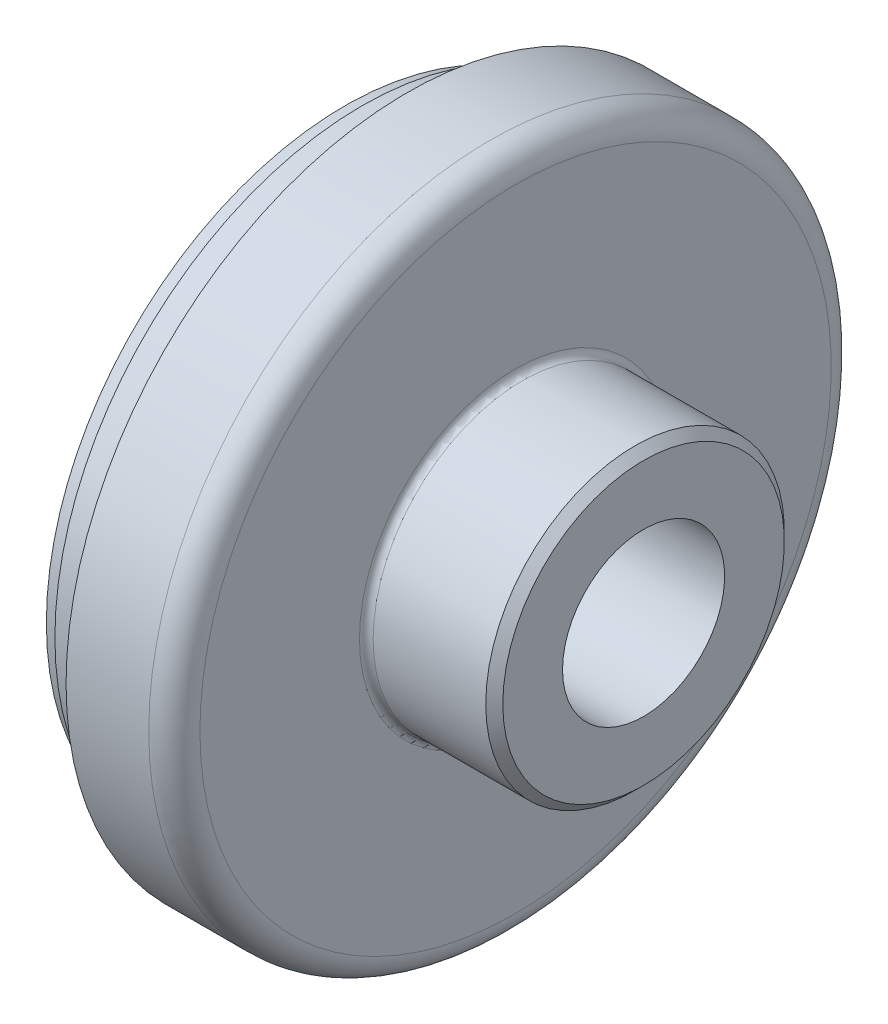
ISO-10303-21;
HEADER;
FILE_DESCRIPTION(('STEP AP214'),'2;1');
FILE_NAME('part.step','',(''),(''),'','','');
FILE_SCHEMA(('AUTOMOTIVE_DESIGN { 1 0 10303 214 1 1 1 1 }'));
ENDSEC;
DATA;
#1=APPLICATION_CONTEXT('core data for automotive mechanical design processes');
#2=APPLICATION_PROTOCOL_DEFINITION('international standard','automotive_design',2000,#1);
#3=PRODUCT_CONTEXT('',#1,'mechanical');
#4=PRODUCT('Part','Part','',(#3));
#5=PRODUCT_RELATED_PRODUCT_CATEGORY('part','',(#4));
#6=PRODUCT_DEFINITION_FORMATION('','',#4);
#7=PRODUCT_DEFINITION_CONTEXT('part definition',#1,'design');
#8=PRODUCT_DEFINITION('design','',#6,#7);
#9=PRODUCT_DEFINITION_SHAPE('','',#8);
#10=(LENGTH_UNIT() NAMED_UNIT(*) SI_UNIT(.MILLI.,.METRE.));
#11=(NAMED_UNIT(*) PLANE_ANGLE_UNIT() SI_UNIT($,.RADIAN.));
#12=(NAMED_UNIT(*) SI_UNIT($,.STERADIAN.) SOLID_ANGLE_UNIT());
#13=UNCERTAINTY_MEASURE_WITH_UNIT(LENGTH_MEASURE(1.E-05),#10,'distance_accuracy_value','');
#14=(GEOMETRIC_REPRESENTATION_CONTEXT(3) GLOBAL_UNCERTAINTY_ASSIGNED_CONTEXT((#13)) GLOBAL_UNIT_ASSIGNED_CONTEXT((#10,
#11,#12)) REPRESENTATION_CONTEXT('',''));
#15=CARTESIAN_POINT('',(0.,0.,0.));
#16=DIRECTION('',(0.,0.,1.));
#17=DIRECTION('',(1.,0.,0.));
#18=AXIS2_PLACEMENT_3D('',#15,#16,#17);
#19=CARTESIAN_POINT('',(0.,35.,0.));
#20=DIRECTION('',(1.,0.,0.));
#21=DIRECTION('',(0.,0.,-1.));
#22=AXIS2_PLACEMENT_3D('',#19,#20,#21);
#23=PLANE('',#22);
#24=CARTESIAN_POINT('',(0.,0.,0.));
#25=DIRECTION('',(-1.,0.,0.));
#26=DIRECTION('',(0.,0.,1.));
#27=AXIS2_PLACEMENT_3D('',#24,#25,#26);
#28=CIRCLE('',#27,9.5);
#29=CARTESIAN_POINT('',(0.,0.,9.5));
#30=VERTEX_POINT('',#29);
#31=EDGE_CURVE('E88',#30,#30,#28,.T.);
#32=ORIENTED_EDGE('',*,*,#31,.F.);
#33=EDGE_LOOP('',(#32));
#34=FACE_BOUND('',#33,.T.);
#35=CARTESIAN_POINT('',(0.,0.,0.));
#36=DIRECTION('',(-1.,0.,0.));
#37=DIRECTION('',(0.,0.,1.));
#38=AXIS2_PLACEMENT_3D('',#35,#36,#37);
#39=CIRCLE('',#38,35.);
#40=CARTESIAN_POINT('',(0.,0.,35.));
#41=VERTEX_POINT('',#40);
#42=EDGE_CURVE('E10',#41,#41,#39,.T.);
#43=ORIENTED_EDGE('',*,*,#42,.T.);
#44=EDGE_LOOP('',(#43));
#45=FACE_BOUND('',#44,.T.);
#46=ADVANCED_FACE('F45',(#34,#45),#23,.F.);
#47=CARTESIAN_POINT('',(-31.2769039735099,0.,0.));
#48=DIRECTION('',(-1.,0.,0.));
#49=DIRECTION('',(0.,0.,1.));
#50=AXIS2_PLACEMENT_3D('',#47,#48,#49);
#51=CYLINDRICAL_SURFACE('',#50,35.);
#52=ORIENTED_EDGE('',*,*,#42,.F.);
#53=EDGE_LOOP('',(#52));
#54=FACE_BOUND('',#53,.T.);
#55=CARTESIAN_POINT('',(2.,0.,0.));
#56=DIRECTION('',(-1.,0.,0.));
#57=DIRECTION('',(0.,0.,1.));
#58=AXIS2_PLACEMENT_3D('',#55,#56,#57);
#59=CIRCLE('',#58,35.);
#60=CARTESIAN_POINT('',(2.,0.,35.));
#61=VERTEX_POINT('',#60);
#62=EDGE_CURVE('E51',#61,#61,#59,.T.);
#63=ORIENTED_EDGE('',*,*,#62,.T.);
#64=EDGE_LOOP('',(#63));
#65=FACE_BOUND('',#64,.T.);
#66=ADVANCED_FACE('F95',(#54,#65),#51,.T.);
#67=CARTESIAN_POINT('',(2.,36.,0.));
#68=DIRECTION('',(1.,0.,0.));
#69=DIRECTION('',(0.,0.,-1.));
#70=AXIS2_PLACEMENT_3D('',#67,#68,#69);
#71=PLANE('',#70);
#72=ORIENTED_EDGE('',*,*,#62,.F.);
#73=EDGE_LOOP('',(#72));
#74=FACE_BOUND('',#73,.T.);
#75=CARTESIAN_POINT('',(2.,0.,0.));
#76=DIRECTION('',(-1.,0.,0.));
#77=DIRECTION('',(0.,0.,1.));
#78=AXIS2_PLACEMENT_3D('',#75,#76,#77);
#79=CIRCLE('',#78,36.);
#80=CARTESIAN_POINT('',(2.,0.,36.));
#81=VERTEX_POINT('',#80);
#82=EDGE_CURVE('E55',#81,#81,#79,.T.);
#83=ORIENTED_EDGE('',*,*,#82,.T.);
#84=EDGE_LOOP('',(#83));
#85=FACE_BOUND('',#84,.T.);
#86=ADVANCED_FACE('F99',(#74,#85),#71,.F.);
#87=CARTESIAN_POINT('',(-31.2769039735099,0.,0.));
#88=DIRECTION('',(-1.,0.,0.));
#89=DIRECTION('',(0.,0.,1.));
#90=AXIS2_PLACEMENT_3D('',#87,#88,#89);
#91=CYLINDRICAL_SURFACE('',#90,36.);
#92=ORIENTED_EDGE('',*,*,#82,.F.);
#93=EDGE_LOOP('',(#92));
#94=FACE_BOUND('',#93,.T.);
#95=CARTESIAN_POINT('',(5.,0.,0.));
#96=DIRECTION('',(-1.,0.,0.));
#97=DIRECTION('',(0.,0.,1.));
#98=AXIS2_PLACEMENT_3D('',#95,#96,#97);
#99=CIRCLE('',#98,36.);
#100=CARTESIAN_POINT('',(5.,0.,36.));
#101=VERTEX_POINT('',#100);
#102=EDGE_CURVE('E59',#101,#101,#99,.T.);
#103=ORIENTED_EDGE('',*,*,#102,.T.);
#104=EDGE_LOOP('',(#103));
#105=FACE_BOUND('',#104,.T.);
#106=ADVANCED_FACE('F104',(#94,#105),#91,.T.);
#107=CARTESIAN_POINT('',(7.30940107675851,0.,0.));
#108=DIRECTION('',(1.,0.,0.));
#109=DIRECTION('',(0.,0.,-1.));
#110=AXIS2_PLACEMENT_3D('',#107,#108,#109);
#111=CONICAL_SURFACE('',#110,40.,1.0471975511966);
#112=ORIENTED_EDGE('',*,*,#102,.F.);
#113=EDGE_LOOP('',(#112));
#114=FACE_BOUND('',#113,.T.);
#115=CARTESIAN_POINT('',(7.30940107675851,0.,0.));
#116=DIRECTION('',(-1.,0.,0.));
#117=DIRECTION('',(0.,0.,1.));
#118=AXIS2_PLACEMENT_3D('',#115,#116,#117);
#119=CIRCLE('',#118,40.);
#120=CARTESIAN_POINT('',(7.30940107675851,0.,40.));
#121=VERTEX_POINT('',#120);
#122=EDGE_CURVE('E64',#121,#121,#119,.T.);
#123=ORIENTED_EDGE('',*,*,#122,.T.);
#124=EDGE_LOOP('',(#123));
#125=FACE_BOUND('',#124,.T.);
#126=ADVANCED_FACE('F110',(#114,#125),#111,.T.);
#127=CARTESIAN_POINT('',(-31.2769039735099,0.,0.));
#128=DIRECTION('',(-1.,0.,0.));
#129=DIRECTION('',(0.,0.,1.));
#130=AXIS2_PLACEMENT_3D('',#127,#128,#129);
#131=CYLINDRICAL_SURFACE('',#130,40.);
#132=ORIENTED_EDGE('',*,*,#122,.F.);
#133=EDGE_LOOP('',(#132));
#134=FACE_BOUND('',#133,.T.);
#135=CARTESIAN_POINT('',(17.,0.,0.));
#136=DIRECTION('',(-1.,0.,0.));
#137=DIRECTION('',(0.,0.,1.));
#138=AXIS2_PLACEMENT_3D('',#135,#136,#137);
#139=CIRCLE('',#138,40.);
#140=CARTESIAN_POINT('',(17.,0.,40.));
#141=VERTEX_POINT('',#140);
#142=EDGE_CURVE('E67',#141,#141,#139,.T.);
#143=ORIENTED_EDGE('',*,*,#142,.T.);
#144=EDGE_LOOP('',(#143));
#145=FACE_BOUND('',#144,.T.);
#146=ADVANCED_FACE('F114',(#134,#145),#131,.T.);
#147=CARTESIAN_POINT('',(17.,0.,0.));
#148=DIRECTION('',(-1.,0.,0.));
#149=DIRECTION('',(0.,0.,1.));
#150=AXIS2_PLACEMENT_3D('',#147,#148,#149);
#151=TOROIDAL_SURFACE('',#150,37.,3.);
#152=ORIENTED_EDGE('',*,*,#142,.F.);
#153=EDGE_LOOP('',(#152));
#154=FACE_BOUND('',#153,.T.);
#155=CARTESIAN_POINT('',(20.,0.,0.));
#156=DIRECTION('',(-1.,0.,0.));
#157=DIRECTION('',(0.,0.,1.));
#158=AXIS2_PLACEMENT_3D('',#155,#156,#157);
#159=CIRCLE('',#158,37.);
#160=CARTESIAN_POINT('',(20.,0.,37.));
#161=VERTEX_POINT('',#160);
#162=EDGE_CURVE('E70',#161,#161,#159,.T.);
#163=ORIENTED_EDGE('',*,*,#162,.T.);
#164=EDGE_LOOP('',(#163));
#165=FACE_BOUND('',#164,.T.);
#166=ADVANCED_FACE('F118',(#154,#165),#151,.T.);
#167=CARTESIAN_POINT('',(20.,18.3,0.));
#168=DIRECTION('',(-1.,0.,0.));
#169=DIRECTION('',(0.,0.,1.));
#170=AXIS2_PLACEMENT_3D('',#167,#168,#169);
#171=PLANE('',#170);
#172=ORIENTED_EDGE('',*,*,#162,.F.);
#173=EDGE_LOOP('',(#172));
#174=FACE_BOUND('',#173,.T.);
#175=CARTESIAN_POINT('',(20.,0.,0.));
#176=DIRECTION('',(-1.,0.,0.));
#177=DIRECTION('',(0.,0.,1.));
#178=AXIS2_PLACEMENT_3D('',#175,#176,#177);
#179=CIRCLE('',#178,18.3);
#180=CARTESIAN_POINT('',(20.,0.,18.3));
#181=VERTEX_POINT('',#180);
#182=EDGE_CURVE('E73',#181,#181,#179,.T.);
#183=ORIENTED_EDGE('',*,*,#182,.T.);
#184=EDGE_LOOP('',(#183));
#185=FACE_BOUND('',#184,.T.);
#186=ADVANCED_FACE('F122',(#174,#185),#171,.F.);
#187=CARTESIAN_POINT('',(20.8,0.,0.));
#188=DIRECTION('',(-1.,0.,0.));
#189=DIRECTION('',(0.,0.,1.));
#190=AXIS2_PLACEMENT_3D('',#187,#188,#189);
#191=TOROIDAL_SURFACE('',#190,18.3,0.799999999999999);
#192=ORIENTED_EDGE('',*,*,#182,.F.);
#193=EDGE_LOOP('',(#192));
#194=FACE_BOUND('',#193,.T.);
#195=CARTESIAN_POINT('',(20.8,0.,0.));
#196=DIRECTION('',(-1.,0.,0.));
#197=DIRECTION('',(0.,0.,1.));
#198=AXIS2_PLACEMENT_3D('',#195,#196,#197);
#199=CIRCLE('',#198,17.5);
#200=CARTESIAN_POINT('',(20.8,0.,17.5));
#201=VERTEX_POINT('',#200);
#202=EDGE_CURVE('E76',#201,#201,#199,.T.);
#203=ORIENTED_EDGE('',*,*,#202,.T.);
#204=EDGE_LOOP('',(#203));
#205=FACE_BOUND('',#204,.T.);
#206=ADVANCED_FACE('F126',(#194,#205),#191,.F.);
#207=CARTESIAN_POINT('',(-31.2769039735099,0.,0.));
#208=DIRECTION('',(-1.,0.,0.));
#209=DIRECTION('',(0.,0.,1.));
#210=AXIS2_PLACEMENT_3D('',#207,#208,#209);
#211=CYLINDRICAL_SURFACE('',#210,17.5);
#212=ORIENTED_EDGE('',*,*,#202,.F.);
#213=EDGE_LOOP('',(#212));
#214=FACE_BOUND('',#213,.T.);
#215=CARTESIAN_POINT('',(34.,0.,0.));
#216=DIRECTION('',(-1.,0.,0.));
#217=DIRECTION('',(0.,0.,1.));
#218=AXIS2_PLACEMENT_3D('',#215,#216,#217);
#219=CIRCLE('',#218,17.5);
#220=CARTESIAN_POINT('',(34.,0.,17.5));
#221=VERTEX_POINT('',#220);
#222=EDGE_CURVE('E79',#221,#221,#219,.T.);
#223=ORIENTED_EDGE('',*,*,#222,.T.);
#224=EDGE_LOOP('',(#223));
#225=FACE_BOUND('',#224,.T.);
#226=ADVANCED_FACE('F130',(#214,#225),#211,.T.);
#227=CARTESIAN_POINT('',(35.,0.,0.));
#228=DIRECTION('',(-1.,0.,0.));
#229=DIRECTION('',(0.,0.,1.));
#230=AXIS2_PLACEMENT_3D('',#227,#228,#229);
#231=CONICAL_SURFACE('',#230,16.5,0.785398163397452);
#232=ORIENTED_EDGE('',*,*,#222,.F.);
#233=EDGE_LOOP('',(#232));
#234=FACE_BOUND('',#233,.T.);
#235=CARTESIAN_POINT('',(35.,0.,0.));
#236=DIRECTION('',(-1.,0.,0.));
#237=DIRECTION('',(0.,0.,1.));
#238=AXIS2_PLACEMENT_3D('',#235,#236,#237);
#239=CIRCLE('',#238,16.5);
#240=CARTESIAN_POINT('',(35.,0.,16.5));
#241=VERTEX_POINT('',#240);
#242=EDGE_CURVE('E82',#241,#241,#239,.T.);
#243=ORIENTED_EDGE('',*,*,#242,.T.);
#244=EDGE_LOOP('',(#243));
#245=FACE_BOUND('',#244,.T.);
#246=ADVANCED_FACE('F134',(#234,#245),#231,.T.);
#247=CARTESIAN_POINT('',(35.,9.5,0.));
#248=DIRECTION('',(-1.,0.,0.));
#249=DIRECTION('',(0.,0.,1.));
#250=AXIS2_PLACEMENT_3D('',#247,#248,#249);
#251=PLANE('',#250);
#252=ORIENTED_EDGE('',*,*,#242,.F.);
#253=EDGE_LOOP('',(#252));
#254=FACE_BOUND('',#253,.T.);
#255=CARTESIAN_POINT('',(35.,0.,0.));
#256=DIRECTION('',(-1.,0.,0.));
#257=DIRECTION('',(0.,0.,1.));
#258=AXIS2_PLACEMENT_3D('',#255,#256,#257);
#259=CIRCLE('',#258,9.5);
#260=CARTESIAN_POINT('',(35.,0.,9.5));
#261=VERTEX_POINT('',#260);
#262=EDGE_CURVE('E85',#261,#261,#259,.T.);
#263=ORIENTED_EDGE('',*,*,#262,.T.);
#264=EDGE_LOOP('',(#263));
#265=FACE_BOUND('',#264,.T.);
#266=ADVANCED_FACE('F138',(#254,#265),#251,.F.);
#267=CARTESIAN_POINT('',(-31.2769039735099,0.,0.));
#268=DIRECTION('',(-1.,0.,0.));
#269=DIRECTION('',(0.,0.,1.));
#270=AXIS2_PLACEMENT_3D('',#267,#268,#269);
#271=CYLINDRICAL_SURFACE('',#270,9.5);
#272=ORIENTED_EDGE('',*,*,#262,.F.);
#273=EDGE_LOOP('',(#272));
#274=FACE_BOUND('',#273,.T.);
#275=ORIENTED_EDGE('',*,*,#31,.T.);
#276=EDGE_LOOP('',(#275));
#277=FACE_BOUND('',#276,.T.);
#278=ADVANCED_FACE('F92',(#274,#277),#271,.F.);
#279=CLOSED_SHELL('',(#46,#66,#86,#106,#126,#146,#166,#186,#206,#226,#246,#266,#278));
#280=MANIFOLD_SOLID_BREP('B2',#279);
#281=ADVANCED_BREP_SHAPE_REPRESENTATION('',(#18,#280),#14);
#282=SHAPE_DEFINITION_REPRESENTATION(#9,#281);
ENDSEC;
END-ISO-10303-21;
